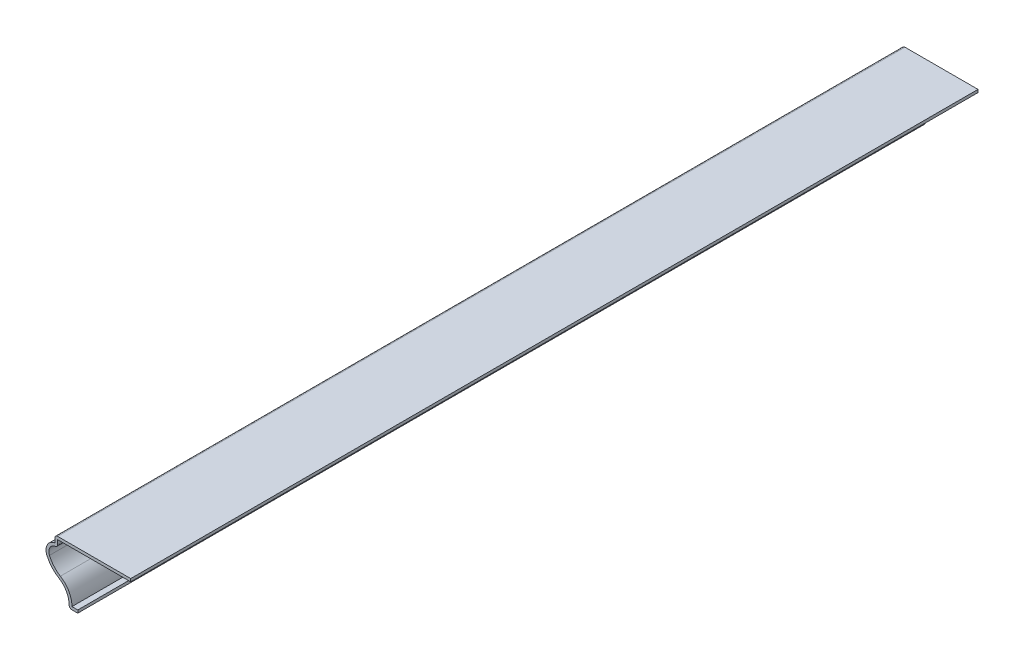
ISO-10303-21;
HEADER;
FILE_DESCRIPTION(('STEP AP214'),'2;1');
FILE_NAME('part.step','',(''),(''),'','','');
FILE_SCHEMA(('AUTOMOTIVE_DESIGN { 1 0 10303 214 1 1 1 1 }'));
ENDSEC;
DATA;
#1=APPLICATION_CONTEXT('core data for automotive mechanical design processes');
#2=APPLICATION_PROTOCOL_DEFINITION('international standard','automotive_design',2000,#1);
#3=PRODUCT_CONTEXT('',#1,'mechanical');
#4=PRODUCT('Part','Part','',(#3));
#5=PRODUCT_RELATED_PRODUCT_CATEGORY('part','',(#4));
#6=PRODUCT_DEFINITION_FORMATION('','',#4);
#7=PRODUCT_DEFINITION_CONTEXT('part definition',#1,'design');
#8=PRODUCT_DEFINITION('design','',#6,#7);
#9=PRODUCT_DEFINITION_SHAPE('','',#8);
#10=(LENGTH_UNIT() NAMED_UNIT(*) SI_UNIT(.MILLI.,.METRE.));
#11=(NAMED_UNIT(*) PLANE_ANGLE_UNIT() SI_UNIT($,.RADIAN.));
#12=(NAMED_UNIT(*) SI_UNIT($,.STERADIAN.) SOLID_ANGLE_UNIT());
#13=UNCERTAINTY_MEASURE_WITH_UNIT(LENGTH_MEASURE(1.E-05),#10,'distance_accuracy_value','');
#14=(GEOMETRIC_REPRESENTATION_CONTEXT(3) GLOBAL_UNCERTAINTY_ASSIGNED_CONTEXT((#13)) GLOBAL_UNIT_ASSIGNED_CONTEXT((#10,
#11,#12)) REPRESENTATION_CONTEXT('',''));
#15=CARTESIAN_POINT('',(0.,0.,0.));
#16=DIRECTION('',(0.,0.,1.));
#17=DIRECTION('',(1.,0.,0.));
#18=AXIS2_PLACEMENT_3D('',#15,#16,#17);
#19=CARTESIAN_POINT('',(-10.31875,24.13,-381.));
#20=DIRECTION('',(0.,-1.,0.));
#21=DIRECTION('',(1.,0.,0.));
#22=AXIS2_PLACEMENT_3D('',#19,#20,#21);
#23=PLANE('',#22);
#24=DIRECTION('',(1.,0.,0.));
#25=VECTOR('',#24,1.);
#26=CARTESIAN_POINT('',(-10.31875,24.13,0.));
#27=LINE('',#26,#25);
#28=CARTESIAN_POINT('',(-9.04875,24.13,0.));
#29=VERTEX_POINT('',#28);
#30=CARTESIAN_POINT('',(23.8125,24.13,0.));
#31=VERTEX_POINT('',#30);
#32=EDGE_CURVE('E210',#29,#31,#27,.T.);
#33=ORIENTED_EDGE('',*,*,#32,.F.);
#34=DIRECTION('',(0.,0.,1.));
#35=VECTOR('',#34,1.);
#36=CARTESIAN_POINT('',(-9.04875,24.13,-381.));
#37=LINE('',#36,#35);
#38=CARTESIAN_POINT('',(-9.04875,24.13,-381.));
#39=VERTEX_POINT('',#38);
#40=EDGE_CURVE('E178',#39,#29,#37,.T.);
#41=ORIENTED_EDGE('',*,*,#40,.F.);
#42=DIRECTION('',(1.,0.,0.));
#43=VECTOR('',#42,1.);
#44=CARTESIAN_POINT('',(-10.31875,24.13,-381.));
#45=LINE('',#44,#43);
#46=CARTESIAN_POINT('',(23.8125,24.13,-381.));
#47=VERTEX_POINT('',#46);
#48=EDGE_CURVE('E159',#39,#47,#45,.T.);
#49=ORIENTED_EDGE('',*,*,#48,.T.);
#50=DIRECTION('',(0.,0.,1.));
#51=VECTOR('',#50,1.);
#52=CARTESIAN_POINT('',(23.8125,24.13,-381.));
#53=LINE('',#52,#51);
#54=EDGE_CURVE('E166',#47,#31,#53,.T.);
#55=ORIENTED_EDGE('',*,*,#54,.T.);
#56=EDGE_LOOP('',(#33,#41,#49,#55));
#57=FACE_BOUND('',#56,.T.);
#58=ADVANCED_FACE('F35',(#57),#23,.T.);
#59=CARTESIAN_POINT('',(-9.04875,22.225,-381.));
#60=DIRECTION('',(1.,0.,0.));
#61=DIRECTION('',(0.,0.,-1.));
#62=AXIS2_PLACEMENT_3D('',#59,#60,#61);
#63=PLANE('',#62);
#64=DIRECTION('',(0.,1.,0.));
#65=VECTOR('',#64,1.);
#66=CARTESIAN_POINT('',(-9.04875,22.225,0.));
#67=LINE('',#66,#65);
#68=CARTESIAN_POINT('',(-9.04875,22.225,0.));
#69=VERTEX_POINT('',#68);
#70=EDGE_CURVE('E179',#69,#29,#67,.T.);
#71=ORIENTED_EDGE('',*,*,#70,.F.);
#72=DIRECTION('',(0.,0.,1.));
#73=VECTOR('',#72,1.);
#74=CARTESIAN_POINT('',(-9.04875,22.225,-381.));
#75=LINE('',#74,#73);
#76=CARTESIAN_POINT('',(-9.04875,22.225,-381.));
#77=VERTEX_POINT('',#76);
#78=EDGE_CURVE('E280',#69,#77,#75,.F.);
#79=ORIENTED_EDGE('',*,*,#78,.T.);
#80=DIRECTION('',(0.,1.,0.));
#81=VECTOR('',#80,1.);
#82=CARTESIAN_POINT('',(-9.04875,22.225,-381.));
#83=LINE('',#82,#81);
#84=EDGE_CURVE('E174',#77,#39,#83,.T.);
#85=ORIENTED_EDGE('',*,*,#84,.T.);
#86=ORIENTED_EDGE('',*,*,#40,.T.);
#87=EDGE_LOOP('',(#71,#79,#85,#86));
#88=FACE_BOUND('',#87,.T.);
#89=ADVANCED_FACE('F294',(#88),#63,.T.);
#90=CARTESIAN_POINT('',(-9.525,17.5291116721647,-381.));
#91=DIRECTION('',(0.,0.,1.));
#92=DIRECTION('',(1.,0.,0.));
#93=AXIS2_PLACEMENT_3D('',#90,#91,#92);
#94=CYLINDRICAL_SURFACE('',#93,3.4925);
#95=CARTESIAN_POINT('',(-9.525,17.5291116721647,-381.));
#96=DIRECTION('',(0.,0.,1.));
#97=DIRECTION('',(1.,0.,0.));
#98=AXIS2_PLACEMENT_3D('',#95,#96,#97);
#99=CIRCLE('',#98,3.4925);
#100=CARTESIAN_POINT('',(-12.7350719214437,16.1532503022736,-381.));
#101=VERTEX_POINT('',#100);
#102=CARTESIAN_POINT('',(-10.1070833333333,20.9727631125772,-381.));
#103=VERTEX_POINT('',#102);
#104=EDGE_CURVE('E206',#101,#103,#99,.F.);
#105=ORIENTED_EDGE('',*,*,#104,.T.);
#106=DIRECTION('',(0.,0.,1.));
#107=VECTOR('',#106,1.);
#108=CARTESIAN_POINT('',(-10.1070833333333,20.9727631125772,-381.));
#109=LINE('',#108,#107);
#110=CARTESIAN_POINT('',(-10.1070833333333,20.9727631125772,0.));
#111=VERTEX_POINT('',#110);
#112=EDGE_CURVE('E277',#103,#111,#109,.T.);
#113=ORIENTED_EDGE('',*,*,#112,.T.);
#114=CARTESIAN_POINT('',(-9.525,17.5291116721647,0.));
#115=DIRECTION('',(0.,0.,1.));
#116=DIRECTION('',(1.,0.,0.));
#117=AXIS2_PLACEMENT_3D('',#114,#115,#116);
#118=CIRCLE('',#117,3.4925);
#119=CARTESIAN_POINT('',(-12.7350719214437,16.1532503022736,0.));
#120=VERTEX_POINT('',#119);
#121=EDGE_CURVE('E181',#120,#111,#118,.F.);
#122=ORIENTED_EDGE('',*,*,#121,.F.);
#123=DIRECTION('',(0.,0.,1.));
#124=VECTOR('',#123,1.);
#125=CARTESIAN_POINT('',(-12.7350719214437,16.1532503022736,-381.));
#126=LINE('',#125,#124);
#127=EDGE_CURVE('E241',#101,#120,#126,.T.);
#128=ORIENTED_EDGE('',*,*,#127,.F.);
#129=EDGE_LOOP('',(#105,#113,#122,#128));
#130=FACE_BOUND('',#129,.T.);
#131=ADVANCED_FACE('F302',(#130),#94,.F.);
#132=CARTESIAN_POINT('',(-1.49982019639066,20.9687650968923,-381.));
#133=DIRECTION('',(0.,0.,1.));
#134=DIRECTION('',(1.,0.,0.));
#135=AXIS2_PLACEMENT_3D('',#132,#133,#134);
#136=CYLINDRICAL_SURFACE('',#135,12.22375);
#137=CARTESIAN_POINT('',(-1.49982019639066,20.9687650968923,0.));
#138=DIRECTION('',(0.,0.,1.));
#139=DIRECTION('',(1.,0.,0.));
#140=AXIS2_PLACEMENT_3D('',#137,#138,#139);
#141=CIRCLE('',#140,12.22375);
#142=CARTESIAN_POINT('',(-7.82384796382554,10.5080415626805,0.));
#143=VERTEX_POINT('',#142);
#144=EDGE_CURVE('E234',#143,#120,#141,.F.);
#145=ORIENTED_EDGE('',*,*,#144,.F.);
#146=DIRECTION('',(0.,0.,1.));
#147=VECTOR('',#146,1.);
#148=CARTESIAN_POINT('',(-7.82384796382554,10.5080415626805,-381.));
#149=LINE('',#148,#147);
#150=CARTESIAN_POINT('',(-7.82384796382554,10.5080415626805,-381.));
#151=VERTEX_POINT('',#150);
#152=EDGE_CURVE('E243',#151,#143,#149,.T.);
#153=ORIENTED_EDGE('',*,*,#152,.F.);
#154=CARTESIAN_POINT('',(-1.49982019639066,20.9687650968923,-381.));
#155=DIRECTION('',(0.,0.,1.));
#156=DIRECTION('',(1.,0.,0.));
#157=AXIS2_PLACEMENT_3D('',#154,#155,#156);
#158=CIRCLE('',#157,12.22375);
#159=EDGE_CURVE('E203',#151,#101,#158,.F.);
#160=ORIENTED_EDGE('',*,*,#159,.T.);
#161=ORIENTED_EDGE('',*,*,#127,.T.);
#162=EDGE_LOOP('',(#145,#153,#160,#161));
#163=FACE_BOUND('',#162,.T.);
#164=ADVANCED_FACE('F306',(#163),#136,.F.);
#165=CARTESIAN_POINT('',(-13.4087036545473,1.27,-381.));
#166=DIRECTION('',(0.,0.,1.));
#167=DIRECTION('',(1.,0.,0.));
#168=AXIS2_PLACEMENT_3D('',#165,#166,#167);
#169=CYLINDRICAL_SURFACE('',#168,10.795);
#170=CARTESIAN_POINT('',(-13.4087036545473,1.27,0.));
#171=DIRECTION('',(0.,0.,1.));
#172=DIRECTION('',(1.,0.,0.));
#173=AXIS2_PLACEMENT_3D('',#170,#171,#172);
#174=CIRCLE('',#173,10.795);
#175=CARTESIAN_POINT('',(-2.61370365454725,1.27,0.));
#176=VERTEX_POINT('',#175);
#177=EDGE_CURVE('E231',#176,#143,#174,.T.);
#178=ORIENTED_EDGE('',*,*,#177,.F.);
#179=DIRECTION('',(0.,0.,1.));
#180=VECTOR('',#179,1.);
#181=CARTESIAN_POINT('',(-2.61370365454725,1.27,-381.));
#182=LINE('',#181,#180);
#183=CARTESIAN_POINT('',(-2.61370365454725,1.27,-381.));
#184=VERTEX_POINT('',#183);
#185=EDGE_CURVE('E245',#184,#176,#182,.T.);
#186=ORIENTED_EDGE('',*,*,#185,.F.);
#187=CARTESIAN_POINT('',(-13.4087036545473,1.27,-381.));
#188=DIRECTION('',(0.,0.,1.));
#189=DIRECTION('',(1.,0.,0.));
#190=AXIS2_PLACEMENT_3D('',#187,#188,#189);
#191=CIRCLE('',#190,10.795);
#192=EDGE_CURVE('E200',#184,#151,#191,.T.);
#193=ORIENTED_EDGE('',*,*,#192,.T.);
#194=ORIENTED_EDGE('',*,*,#152,.T.);
#195=EDGE_LOOP('',(#178,#186,#193,#194));
#196=FACE_BOUND('',#195,.T.);
#197=ADVANCED_FACE('F311',(#196),#169,.T.);
#198=CARTESIAN_POINT('',(0.,1.27,-381.));
#199=DIRECTION('',(0.,1.,0.));
#200=DIRECTION('',(-1.,0.,0.));
#201=AXIS2_PLACEMENT_3D('',#198,#199,#200);
#202=PLANE('',#201);
#203=DIRECTION('',(-1.,0.,0.));
#204=VECTOR('',#203,1.);
#205=CARTESIAN_POINT('',(0.,1.27,0.));
#206=LINE('',#205,#204);
#207=CARTESIAN_POINT('',(0.,1.27,0.));
#208=VERTEX_POINT('',#207);
#209=EDGE_CURVE('E228',#208,#176,#206,.T.);
#210=ORIENTED_EDGE('',*,*,#209,.F.);
#211=DIRECTION('',(0.,0.,1.));
#212=VECTOR('',#211,1.);
#213=CARTESIAN_POINT('',(0.,1.27,-381.));
#214=LINE('',#213,#212);
#215=CARTESIAN_POINT('',(0.,1.27,-381.));
#216=VERTEX_POINT('',#215);
#217=EDGE_CURVE('E247',#216,#208,#214,.T.);
#218=ORIENTED_EDGE('',*,*,#217,.F.);
#219=DIRECTION('',(-1.,0.,0.));
#220=VECTOR('',#219,1.);
#221=CARTESIAN_POINT('',(0.,1.27,-381.));
#222=LINE('',#221,#220);
#223=EDGE_CURVE('E197',#216,#184,#222,.T.);
#224=ORIENTED_EDGE('',*,*,#223,.T.);
#225=ORIENTED_EDGE('',*,*,#185,.T.);
#226=EDGE_LOOP('',(#210,#218,#224,#225));
#227=FACE_BOUND('',#226,.T.);
#228=ADVANCED_FACE('F314',(#227),#202,.T.);
#229=CARTESIAN_POINT('',(0.,1.27,-381.));
#230=DIRECTION('',(-1.,0.,0.));
#231=DIRECTION('',(0.,-1.,0.));
#232=AXIS2_PLACEMENT_3D('',#229,#230,#231);
#233=PLANE('',#232);
#234=DIRECTION('',(0.,-1.,0.));
#235=VECTOR('',#234,1.);
#236=CARTESIAN_POINT('',(0.,1.27,0.));
#237=LINE('',#236,#235);
#238=CARTESIAN_POINT('',(0.,0.,0.));
#239=VERTEX_POINT('',#238);
#240=EDGE_CURVE('E226',#208,#239,#237,.T.);
#241=ORIENTED_EDGE('',*,*,#240,.T.);
#242=DIRECTION('',(0.,0.,1.));
#243=VECTOR('',#242,1.);
#244=CARTESIAN_POINT('',(0.,0.,-381.));
#245=LINE('',#244,#243);
#246=CARTESIAN_POINT('',(0.,0.,-381.));
#247=VERTEX_POINT('',#246);
#248=EDGE_CURVE('E249',#247,#239,#245,.T.);
#249=ORIENTED_EDGE('',*,*,#248,.F.);
#250=DIRECTION('',(0.,-1.,0.));
#251=VECTOR('',#250,1.);
#252=CARTESIAN_POINT('',(0.,1.27,-381.));
#253=LINE('',#252,#251);
#254=EDGE_CURVE('E195',#216,#247,#253,.T.);
#255=ORIENTED_EDGE('',*,*,#254,.F.);
#256=ORIENTED_EDGE('',*,*,#217,.T.);
#257=EDGE_LOOP('',(#241,#249,#255,#256));
#258=FACE_BOUND('',#257,.T.);
#259=ADVANCED_FACE('F320',(#258),#233,.F.);
#260=CARTESIAN_POINT('',(0.,0.,-381.));
#261=DIRECTION('',(0.,1.,0.));
#262=DIRECTION('',(-1.,0.,0.));
#263=AXIS2_PLACEMENT_3D('',#260,#261,#262);
#264=PLANE('',#263);
#265=DIRECTION('',(-1.,0.,0.));
#266=VECTOR('',#265,1.);
#267=CARTESIAN_POINT('',(0.,0.,0.));
#268=LINE('',#267,#266);
#269=CARTESIAN_POINT('',(-2.61370365454725,0.,0.));
#270=VERTEX_POINT('',#269);
#271=EDGE_CURVE('E223',#239,#270,#268,.T.);
#272=ORIENTED_EDGE('',*,*,#271,.T.);
#273=DIRECTION('',(0.,0.,1.));
#274=VECTOR('',#273,1.);
#275=CARTESIAN_POINT('',(-2.61370365454725,0.,-381.));
#276=LINE('',#275,#274);
#277=CARTESIAN_POINT('',(-2.61370365454725,0.,-381.));
#278=VERTEX_POINT('',#277);
#279=EDGE_CURVE('E270',#270,#278,#276,.F.);
#280=ORIENTED_EDGE('',*,*,#279,.T.);
#281=DIRECTION('',(-1.,0.,0.));
#282=VECTOR('',#281,1.);
#283=CARTESIAN_POINT('',(0.,0.,-381.));
#284=LINE('',#283,#282);
#285=EDGE_CURVE('E193',#247,#278,#284,.T.);
#286=ORIENTED_EDGE('',*,*,#285,.F.);
#287=ORIENTED_EDGE('',*,*,#248,.T.);
#288=EDGE_LOOP('',(#272,#280,#286,#287));
#289=FACE_BOUND('',#288,.T.);
#290=ADVANCED_FACE('F324',(#289),#264,.F.);
#291=CARTESIAN_POINT('',(-13.4087036545473,1.27,-381.));
#292=DIRECTION('',(0.,0.,1.));
#293=DIRECTION('',(1.,0.,0.));
#294=AXIS2_PLACEMENT_3D('',#291,#292,#293);
#295=CYLINDRICAL_SURFACE('',#294,9.525);
#296=CARTESIAN_POINT('',(-13.4087036545473,1.27,-381.));
#297=DIRECTION('',(0.,0.,1.));
#298=DIRECTION('',(1.,0.,0.));
#299=AXIS2_PLACEMENT_3D('',#296,#297,#298);
#300=CIRCLE('',#299,9.525);
#301=CARTESIAN_POINT('',(-3.88370365454725,1.27,-381.));
#302=VERTEX_POINT('',#301);
#303=CARTESIAN_POINT('',(-8.4808898097928,9.42121314354166,-381.));
#304=VERTEX_POINT('',#303);
#305=EDGE_CURVE('E191',#302,#304,#300,.T.);
#306=ORIENTED_EDGE('',*,*,#305,.F.);
#307=DIRECTION('',(0.,0.,1.));
#308=VECTOR('',#307,1.);
#309=CARTESIAN_POINT('',(-3.88370365454725,1.27,-381.));
#310=LINE('',#309,#308);
#311=CARTESIAN_POINT('',(-3.88370365454725,1.27,0.));
#312=VERTEX_POINT('',#311);
#313=EDGE_CURVE('E240',#302,#312,#310,.T.);
#314=ORIENTED_EDGE('',*,*,#313,.T.);
#315=CARTESIAN_POINT('',(-13.4087036545473,1.27,0.));
#316=DIRECTION('',(0.,0.,1.));
#317=DIRECTION('',(1.,0.,0.));
#318=AXIS2_PLACEMENT_3D('',#315,#316,#317);
#319=CIRCLE('',#318,9.525);
#320=CARTESIAN_POINT('',(-8.4808898097928,9.42121314354166,0.));
#321=VERTEX_POINT('',#320);
#322=EDGE_CURVE('E221',#312,#321,#319,.T.);
#323=ORIENTED_EDGE('',*,*,#322,.T.);
#324=DIRECTION('',(0.,0.,1.));
#325=VECTOR('',#324,1.);
#326=CARTESIAN_POINT('',(-8.4808898097928,9.42121314354166,-381.));
#327=LINE('',#326,#325);
#328=EDGE_CURVE('E252',#304,#321,#327,.T.);
#329=ORIENTED_EDGE('',*,*,#328,.F.);
#330=EDGE_LOOP('',(#306,#314,#323,#329));
#331=FACE_BOUND('',#330,.T.);
#332=ADVANCED_FACE('F332',(#331),#295,.F.);
#333=CARTESIAN_POINT('',(-1.49982019639066,20.9687650968923,-381.));
#334=DIRECTION('',(0.,0.,1.));
#335=DIRECTION('',(1.,0.,0.));
#336=AXIS2_PLACEMENT_3D('',#333,#334,#335);
#337=CYLINDRICAL_SURFACE('',#336,13.49375);
#338=CARTESIAN_POINT('',(-1.49982019639066,20.9687650968923,0.));
#339=DIRECTION('',(0.,0.,-1.));
#340=DIRECTION('',(-1.,0.,0.));
#341=AXIS2_PLACEMENT_3D('',#338,#339,#340);
#342=CIRCLE('',#341,13.49375);
#343=CARTESIAN_POINT('',(-13.9023708019687,15.6529370768587,0.));
#344=VERTEX_POINT('',#343);
#345=EDGE_CURVE('E219',#321,#344,#342,.T.);
#346=ORIENTED_EDGE('',*,*,#345,.T.);
#347=DIRECTION('',(0.,0.,1.));
#348=VECTOR('',#347,1.);
#349=CARTESIAN_POINT('',(-13.9023708019687,15.6529370768587,-381.));
#350=LINE('',#349,#348);
#351=CARTESIAN_POINT('',(-13.9023708019687,15.6529370768587,-381.));
#352=VERTEX_POINT('',#351);
#353=EDGE_CURVE('E255',#352,#344,#350,.T.);
#354=ORIENTED_EDGE('',*,*,#353,.F.);
#355=CARTESIAN_POINT('',(-1.49982019639066,20.9687650968923,-381.));
#356=DIRECTION('',(0.,0.,-1.));
#357=DIRECTION('',(-1.,0.,0.));
#358=AXIS2_PLACEMENT_3D('',#355,#356,#357);
#359=CIRCLE('',#358,13.49375);
#360=EDGE_CURVE('E189',#304,#352,#359,.T.);
#361=ORIENTED_EDGE('',*,*,#360,.F.);
#362=ORIENTED_EDGE('',*,*,#328,.T.);
#363=EDGE_LOOP('',(#346,#354,#361,#362));
#364=FACE_BOUND('',#363,.T.);
#365=ADVANCED_FACE('F337',(#364),#337,.T.);
#366=CARTESIAN_POINT('',(-9.525,17.5291116721647,-381.));
#367=DIRECTION('',(0.,0.,1.));
#368=DIRECTION('',(1.,0.,0.));
#369=AXIS2_PLACEMENT_3D('',#366,#367,#368);
#370=CYLINDRICAL_SURFACE('',#369,4.7625);
#371=CARTESIAN_POINT('',(-9.525,17.5291116721647,0.));
#372=DIRECTION('',(0.,0.,-1.));
#373=DIRECTION('',(-1.,0.,0.));
#374=AXIS2_PLACEMENT_3D('',#371,#372,#373);
#375=CIRCLE('',#374,4.7625);
#376=CARTESIAN_POINT('',(-10.31875,22.225,0.));
#377=VERTEX_POINT('',#376);
#378=EDGE_CURVE('E217',#344,#377,#375,.T.);
#379=ORIENTED_EDGE('',*,*,#378,.T.);
#380=DIRECTION('',(0.,0.,1.));
#381=VECTOR('',#380,1.);
#382=CARTESIAN_POINT('',(-10.31875,22.225,-381.));
#383=LINE('',#382,#381);
#384=CARTESIAN_POINT('',(-10.31875,22.225,-381.));
#385=VERTEX_POINT('',#384);
#386=EDGE_CURVE('E258',#385,#377,#383,.T.);
#387=ORIENTED_EDGE('',*,*,#386,.F.);
#388=CARTESIAN_POINT('',(-9.525,17.5291116721647,-381.));
#389=DIRECTION('',(0.,0.,-1.));
#390=DIRECTION('',(-1.,0.,0.));
#391=AXIS2_PLACEMENT_3D('',#388,#389,#390);
#392=CIRCLE('',#391,4.7625);
#393=EDGE_CURVE('E187',#352,#385,#392,.T.);
#394=ORIENTED_EDGE('',*,*,#393,.F.);
#395=ORIENTED_EDGE('',*,*,#353,.T.);
#396=EDGE_LOOP('',(#379,#387,#394,#395));
#397=FACE_BOUND('',#396,.T.);
#398=ADVANCED_FACE('F341',(#397),#370,.T.);
#399=CARTESIAN_POINT('',(-10.31875,22.225,-381.));
#400=DIRECTION('',(1.,0.,0.));
#401=DIRECTION('',(0.,0.,-1.));
#402=AXIS2_PLACEMENT_3D('',#399,#400,#401);
#403=PLANE('',#402);
#404=DIRECTION('',(0.,1.,0.));
#405=VECTOR('',#404,1.);
#406=CARTESIAN_POINT('',(-10.31875,22.225,0.));
#407=LINE('',#406,#405);
#408=CARTESIAN_POINT('',(-10.31875,24.13,0.));
#409=VERTEX_POINT('',#408);
#410=EDGE_CURVE('E215',#377,#409,#407,.T.);
#411=ORIENTED_EDGE('',*,*,#410,.T.);
#412=DIRECTION('',(0.,0.,1.));
#413=VECTOR('',#412,1.);
#414=CARTESIAN_POINT('',(-10.31875,24.13,-381.));
#415=LINE('',#414,#413);
#416=CARTESIAN_POINT('',(-10.31875,24.13,-381.));
#417=VERTEX_POINT('',#416);
#418=EDGE_CURVE('E11',#409,#417,#415,.F.);
#419=ORIENTED_EDGE('',*,*,#418,.T.);
#420=DIRECTION('',(0.,1.,0.));
#421=VECTOR('',#420,1.);
#422=CARTESIAN_POINT('',(-10.31875,22.225,-381.));
#423=LINE('',#422,#421);
#424=EDGE_CURVE('E185',#385,#417,#423,.T.);
#425=ORIENTED_EDGE('',*,*,#424,.F.);
#426=ORIENTED_EDGE('',*,*,#386,.T.);
#427=EDGE_LOOP('',(#411,#419,#425,#426));
#428=FACE_BOUND('',#427,.T.);
#429=ADVANCED_FACE('F343',(#428),#403,.F.);
#430=CARTESIAN_POINT('',(-10.31875,25.4,-381.));
#431=DIRECTION('',(0.,-1.,0.));
#432=DIRECTION('',(1.,0.,0.));
#433=AXIS2_PLACEMENT_3D('',#430,#431,#432);
#434=PLANE('',#433);
#435=DIRECTION('',(1.,0.,0.));
#436=VECTOR('',#435,1.);
#437=CARTESIAN_POINT('',(-10.31875,25.4,-381.));
#438=LINE('',#437,#436);
#439=CARTESIAN_POINT('',(-9.04875,25.4,-381.));
#440=VERTEX_POINT('',#439);
#441=CARTESIAN_POINT('',(23.8125,25.4,-381.));
#442=VERTEX_POINT('',#441);
#443=EDGE_CURVE('E160',#440,#442,#438,.T.);
#444=ORIENTED_EDGE('',*,*,#443,.F.);
#445=DIRECTION('',(0.,0.,1.));
#446=VECTOR('',#445,1.);
#447=CARTESIAN_POINT('',(-9.04875,25.4,-381.));
#448=LINE('',#447,#446);
#449=CARTESIAN_POINT('',(-9.04875,25.4,0.));
#450=VERTEX_POINT('',#449);
#451=EDGE_CURVE('E43',#440,#450,#448,.T.);
#452=ORIENTED_EDGE('',*,*,#451,.T.);
#453=DIRECTION('',(1.,0.,0.));
#454=VECTOR('',#453,1.);
#455=CARTESIAN_POINT('',(-10.31875,25.4,0.));
#456=LINE('',#455,#454);
#457=CARTESIAN_POINT('',(23.8125,25.4,0.));
#458=VERTEX_POINT('',#457);
#459=EDGE_CURVE('E213',#450,#458,#456,.T.);
#460=ORIENTED_EDGE('',*,*,#459,.T.);
#461=DIRECTION('',(0.,0.,1.));
#462=VECTOR('',#461,1.);
#463=CARTESIAN_POINT('',(23.8125,25.4,-381.));
#464=LINE('',#463,#462);
#465=EDGE_CURVE('E173',#442,#458,#464,.T.);
#466=ORIENTED_EDGE('',*,*,#465,.F.);
#467=EDGE_LOOP('',(#444,#452,#460,#466));
#468=FACE_BOUND('',#467,.T.);
#469=ADVANCED_FACE('F285',(#468),#434,.F.);
#470=CARTESIAN_POINT('',(23.8125,25.4,-381.));
#471=DIRECTION('',(-1.,0.,0.));
#472=DIRECTION('',(0.,0.,1.));
#473=AXIS2_PLACEMENT_3D('',#470,#471,#472);
#474=PLANE('',#473);
#475=DIRECTION('',(0.,-1.,0.));
#476=VECTOR('',#475,1.);
#477=CARTESIAN_POINT('',(23.8125,25.4,0.));
#478=LINE('',#477,#476);
#479=EDGE_CURVE('E169',#458,#31,#478,.T.);
#480=ORIENTED_EDGE('',*,*,#479,.T.);
#481=ORIENTED_EDGE('',*,*,#54,.F.);
#482=DIRECTION('',(0.,-1.,0.));
#483=VECTOR('',#482,1.);
#484=CARTESIAN_POINT('',(23.8125,25.4,-381.));
#485=LINE('',#484,#483);
#486=EDGE_CURVE('E153',#442,#47,#485,.T.);
#487=ORIENTED_EDGE('',*,*,#486,.F.);
#488=ORIENTED_EDGE('',*,*,#465,.T.);
#489=EDGE_LOOP('',(#480,#481,#487,#488));
#490=FACE_BOUND('',#489,.T.);
#491=ADVANCED_FACE('F167',(#490),#474,.F.);
#492=CARTESIAN_POINT('',(-9.525,17.5291116721647,-381.));
#493=DIRECTION('',(0.,0.,-1.));
#494=DIRECTION('',(-1.,0.,0.));
#495=AXIS2_PLACEMENT_3D('',#492,#493,#494);
#496=PLANE('',#495);
#497=ORIENTED_EDGE('',*,*,#285,.T.);
#498=CARTESIAN_POINT('',(-2.61370365454725,1.27,-381.));
#499=DIRECTION('',(0.,0.,-1.));
#500=DIRECTION('',(-1.,0.,0.));
#501=AXIS2_PLACEMENT_3D('',#498,#499,#500);
#502=CIRCLE('',#501,1.27);
#503=EDGE_CURVE('E275',#278,#302,#502,.T.);
#504=ORIENTED_EDGE('',*,*,#503,.T.);
#505=ORIENTED_EDGE('',*,*,#305,.T.);
#506=ORIENTED_EDGE('',*,*,#360,.T.);
#507=ORIENTED_EDGE('',*,*,#393,.T.);
#508=ORIENTED_EDGE('',*,*,#424,.T.);
#509=CARTESIAN_POINT('',(-9.04875,24.13,-381.));
#510=DIRECTION('',(0.,0.,-1.));
#511=DIRECTION('',(-1.,0.,0.));
#512=AXIS2_PLACEMENT_3D('',#509,#510,#511);
#513=CIRCLE('',#512,1.27);
#514=EDGE_CURVE('E50',#417,#440,#513,.T.);
#515=ORIENTED_EDGE('',*,*,#514,.T.);
#516=ORIENTED_EDGE('',*,*,#443,.T.);
#517=ORIENTED_EDGE('',*,*,#486,.T.);
#518=ORIENTED_EDGE('',*,*,#48,.F.);
#519=ORIENTED_EDGE('',*,*,#84,.F.);
#520=CARTESIAN_POINT('',(-10.31875,22.225,-381.));
#521=DIRECTION('',(0.,0.,-1.));
#522=DIRECTION('',(-1.,0.,0.));
#523=AXIS2_PLACEMENT_3D('',#520,#521,#522);
#524=CIRCLE('',#523,1.27);
#525=EDGE_CURVE('E273',#77,#103,#524,.T.);
#526=ORIENTED_EDGE('',*,*,#525,.T.);
#527=ORIENTED_EDGE('',*,*,#104,.F.);
#528=ORIENTED_EDGE('',*,*,#159,.F.);
#529=ORIENTED_EDGE('',*,*,#192,.F.);
#530=ORIENTED_EDGE('',*,*,#223,.F.);
#531=ORIENTED_EDGE('',*,*,#254,.T.);
#532=EDGE_LOOP('',(#497,#504,#505,#506,#507,#508,#515,#516,#517,#518,#519,#526,#527,#528,#529,
#530,#531));
#533=FACE_BOUND('',#532,.T.);
#534=ADVANCED_FACE('F156',(#533),#496,.T.);
#535=CARTESIAN_POINT('',(-9.525,17.5291116721647,0.));
#536=DIRECTION('',(0.,0.,-1.));
#537=DIRECTION('',(-1.,0.,0.));
#538=AXIS2_PLACEMENT_3D('',#535,#536,#537);
#539=PLANE('',#538);
#540=ORIENTED_EDGE('',*,*,#322,.F.);
#541=CARTESIAN_POINT('',(-2.61370365454725,1.27,0.));
#542=DIRECTION('',(0.,0.,-1.));
#543=DIRECTION('',(-1.,0.,0.));
#544=AXIS2_PLACEMENT_3D('',#541,#542,#543);
#545=CIRCLE('',#544,1.27);
#546=EDGE_CURVE('E268',#312,#270,#545,.F.);
#547=ORIENTED_EDGE('',*,*,#546,.T.);
#548=ORIENTED_EDGE('',*,*,#271,.F.);
#549=ORIENTED_EDGE('',*,*,#240,.F.);
#550=ORIENTED_EDGE('',*,*,#209,.T.);
#551=ORIENTED_EDGE('',*,*,#177,.T.);
#552=ORIENTED_EDGE('',*,*,#144,.T.);
#553=ORIENTED_EDGE('',*,*,#121,.T.);
#554=CARTESIAN_POINT('',(-10.31875,22.225,0.));
#555=DIRECTION('',(0.,0.,-1.));
#556=DIRECTION('',(-1.,0.,0.));
#557=AXIS2_PLACEMENT_3D('',#554,#555,#556);
#558=CIRCLE('',#557,1.27);
#559=EDGE_CURVE('E266',#111,#69,#558,.F.);
#560=ORIENTED_EDGE('',*,*,#559,.T.);
#561=ORIENTED_EDGE('',*,*,#70,.T.);
#562=ORIENTED_EDGE('',*,*,#32,.T.);
#563=ORIENTED_EDGE('',*,*,#479,.F.);
#564=ORIENTED_EDGE('',*,*,#459,.F.);
#565=CARTESIAN_POINT('',(-9.04875,24.13,0.));
#566=DIRECTION('',(0.,0.,-1.));
#567=DIRECTION('',(-1.,0.,0.));
#568=AXIS2_PLACEMENT_3D('',#565,#566,#567);
#569=CIRCLE('',#568,1.27);
#570=EDGE_CURVE('E264',#450,#409,#569,.F.);
#571=ORIENTED_EDGE('',*,*,#570,.T.);
#572=ORIENTED_EDGE('',*,*,#410,.F.);
#573=ORIENTED_EDGE('',*,*,#378,.F.);
#574=ORIENTED_EDGE('',*,*,#345,.F.);
#575=EDGE_LOOP('',(#540,#547,#548,#549,#550,#551,#552,#553,#560,#561,#562,#563,#564,#571,#572,
#573,#574));
#576=FACE_BOUND('',#575,.T.);
#577=ADVANCED_FACE('F289',(#576),#539,.F.);
#578=CARTESIAN_POINT('',(-2.61370365454725,1.27,-381.));
#579=DIRECTION('',(0.,0.,1.));
#580=DIRECTION('',(1.,0.,0.));
#581=AXIS2_PLACEMENT_3D('',#578,#579,#580);
#582=CYLINDRICAL_SURFACE('',#581,1.27);
#583=ORIENTED_EDGE('',*,*,#503,.F.);
#584=ORIENTED_EDGE('',*,*,#279,.F.);
#585=ORIENTED_EDGE('',*,*,#546,.F.);
#586=ORIENTED_EDGE('',*,*,#313,.F.);
#587=EDGE_LOOP('',(#583,#584,#585,#586));
#588=FACE_BOUND('',#587,.T.);
#589=ADVANCED_FACE('F327',(#588),#582,.T.);
#590=CARTESIAN_POINT('',(-10.31875,22.225,-381.));
#591=DIRECTION('',(0.,0.,1.));
#592=DIRECTION('',(1.,0.,0.));
#593=AXIS2_PLACEMENT_3D('',#590,#591,#592);
#594=CYLINDRICAL_SURFACE('',#593,1.27);
#595=ORIENTED_EDGE('',*,*,#525,.F.);
#596=ORIENTED_EDGE('',*,*,#78,.F.);
#597=ORIENTED_EDGE('',*,*,#559,.F.);
#598=ORIENTED_EDGE('',*,*,#112,.F.);
#599=EDGE_LOOP('',(#595,#596,#597,#598));
#600=FACE_BOUND('',#599,.T.);
#601=ADVANCED_FACE('F299',(#600),#594,.T.);
#602=CARTESIAN_POINT('',(-9.04875,24.13,-381.));
#603=DIRECTION('',(0.,0.,1.));
#604=DIRECTION('',(1.,0.,0.));
#605=AXIS2_PLACEMENT_3D('',#602,#603,#604);
#606=CYLINDRICAL_SURFACE('',#605,1.27);
#607=ORIENTED_EDGE('',*,*,#514,.F.);
#608=ORIENTED_EDGE('',*,*,#418,.F.);
#609=ORIENTED_EDGE('',*,*,#570,.F.);
#610=ORIENTED_EDGE('',*,*,#451,.F.);
#611=EDGE_LOOP('',(#607,#608,#609,#610));
#612=FACE_BOUND('',#611,.T.);
#613=ADVANCED_FACE('F37',(#612),#606,.T.);
#614=CLOSED_SHELL('',(#58,#89,#131,#164,#197,#228,#259,#290,#332,#365,#398,#429,#469,#491,#534,
#577,#589,#601,#613));
#615=MANIFOLD_SOLID_BREP('B2',#614);
#616=ADVANCED_BREP_SHAPE_REPRESENTATION('',(#18,#615),#14);
#617=SHAPE_DEFINITION_REPRESENTATION(#9,#616);
ENDSEC;
END-ISO-10303-21;
